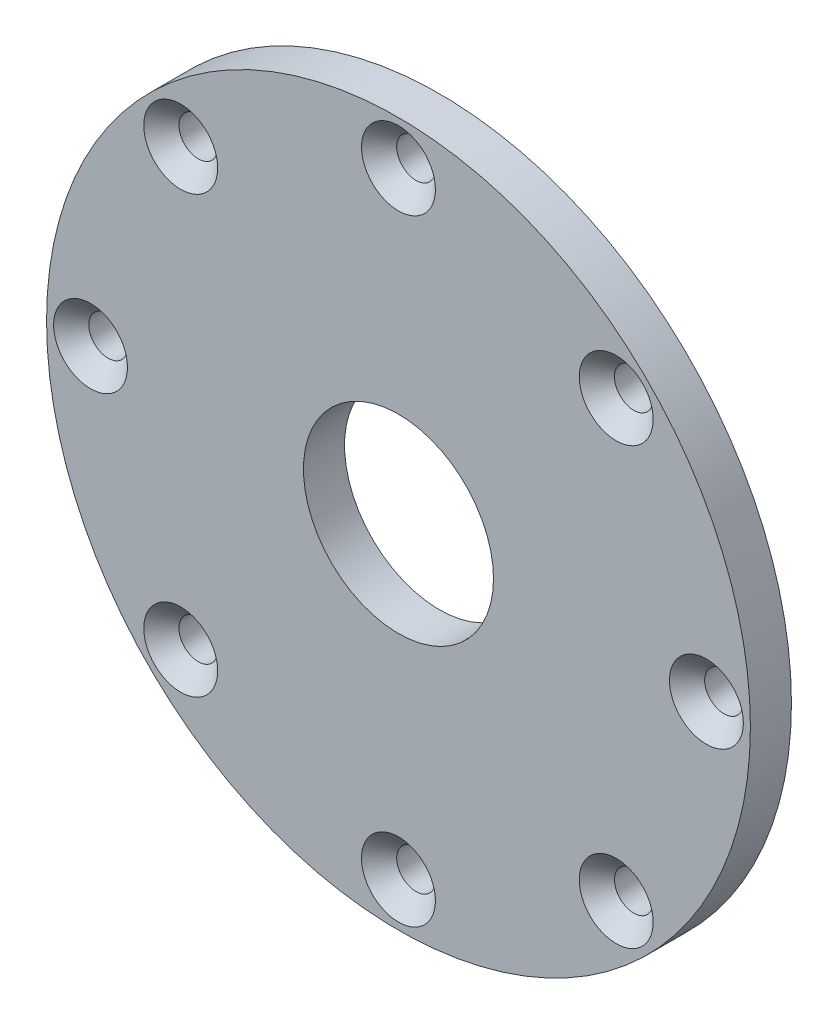
ISO-10303-21;
HEADER;
FILE_DESCRIPTION(('STEP AP214'),'2;1');
FILE_NAME('part.step','',(''),(''),'','','');
FILE_SCHEMA(('AUTOMOTIVE_DESIGN { 1 0 10303 214 1 1 1 1 }'));
ENDSEC;
DATA;
#1=APPLICATION_CONTEXT('core data for automotive mechanical design processes');
#2=APPLICATION_PROTOCOL_DEFINITION('international standard','automotive_design',2000,#1);
#3=PRODUCT_CONTEXT('',#1,'mechanical');
#4=PRODUCT('Part','Part','',(#3));
#5=PRODUCT_RELATED_PRODUCT_CATEGORY('part','',(#4));
#6=PRODUCT_DEFINITION_FORMATION('','',#4);
#7=PRODUCT_DEFINITION_CONTEXT('part definition',#1,'design');
#8=PRODUCT_DEFINITION('design','',#6,#7);
#9=PRODUCT_DEFINITION_SHAPE('','',#8);
#10=(LENGTH_UNIT() NAMED_UNIT(*) SI_UNIT(.MILLI.,.METRE.));
#11=(NAMED_UNIT(*) PLANE_ANGLE_UNIT() SI_UNIT($,.RADIAN.));
#12=(NAMED_UNIT(*) SI_UNIT($,.STERADIAN.) SOLID_ANGLE_UNIT());
#13=UNCERTAINTY_MEASURE_WITH_UNIT(LENGTH_MEASURE(1.E-05),#10,'distance_accuracy_value','');
#14=(GEOMETRIC_REPRESENTATION_CONTEXT(3) GLOBAL_UNCERTAINTY_ASSIGNED_CONTEXT((#13)) GLOBAL_UNIT_ASSIGNED_CONTEXT((#10,
#11,#12)) REPRESENTATION_CONTEXT('',''));
#15=CARTESIAN_POINT('',(0.,0.,0.));
#16=DIRECTION('',(0.,0.,1.));
#17=DIRECTION('',(1.,0.,0.));
#18=AXIS2_PLACEMENT_3D('',#15,#16,#17);
#19=CARTESIAN_POINT('',(0.,0.,7.));
#20=DIRECTION('',(0.,0.,1.));
#21=DIRECTION('',(1.,0.,0.));
#22=AXIS2_PLACEMENT_3D('',#19,#20,#21);
#23=PLANE('',#22);
#24=CARTESIAN_POINT('',(0.,52.5,7.));
#25=DIRECTION('',(0.,0.,1.));
#26=DIRECTION('',(1.,0.,0.));
#27=AXIS2_PLACEMENT_3D('',#24,#25,#26);
#28=CIRCLE('',#27,6.3);
#29=CARTESIAN_POINT('',(6.3,52.5,7.));
#30=VERTEX_POINT('',#29);
#31=EDGE_CURVE('E157',#30,#30,#28,.T.);
#32=ORIENTED_EDGE('',*,*,#31,.F.);
#33=EDGE_LOOP('',(#32));
#34=FACE_BOUND('',#33,.T.);
#35=CARTESIAN_POINT('',(37.1231060122937,37.1231060122937,7.));
#36=DIRECTION('',(0.,0.,1.));
#37=DIRECTION('',(1.,0.,0.));
#38=AXIS2_PLACEMENT_3D('',#35,#36,#37);
#39=CIRCLE('',#38,6.3);
#40=CARTESIAN_POINT('',(43.4231060122937,37.1231060122937,7.));
#41=VERTEX_POINT('',#40);
#42=EDGE_CURVE('E145',#41,#41,#39,.T.);
#43=ORIENTED_EDGE('',*,*,#42,.F.);
#44=EDGE_LOOP('',(#43));
#45=FACE_BOUND('',#44,.T.);
#46=CARTESIAN_POINT('',(52.5,0.,7.));
#47=DIRECTION('',(0.,0.,1.));
#48=DIRECTION('',(1.,0.,0.));
#49=AXIS2_PLACEMENT_3D('',#46,#47,#48);
#50=CIRCLE('',#49,6.3);
#51=CARTESIAN_POINT('',(58.8,0.,7.));
#52=VERTEX_POINT('',#51);
#53=EDGE_CURVE('E133',#52,#52,#50,.T.);
#54=ORIENTED_EDGE('',*,*,#53,.F.);
#55=EDGE_LOOP('',(#54));
#56=FACE_BOUND('',#55,.T.);
#57=CARTESIAN_POINT('',(37.1231060122937,-37.1231060122937,7.));
#58=DIRECTION('',(0.,0.,1.));
#59=DIRECTION('',(1.,0.,0.));
#60=AXIS2_PLACEMENT_3D('',#57,#58,#59);
#61=CIRCLE('',#60,6.3);
#62=CARTESIAN_POINT('',(43.4231060122937,-37.1231060122937,7.));
#63=VERTEX_POINT('',#62);
#64=EDGE_CURVE('E121',#63,#63,#61,.T.);
#65=ORIENTED_EDGE('',*,*,#64,.F.);
#66=EDGE_LOOP('',(#65));
#67=FACE_BOUND('',#66,.T.);
#68=CARTESIAN_POINT('',(0.,-52.5,7.));
#69=DIRECTION('',(0.,0.,1.));
#70=DIRECTION('',(1.,0.,0.));
#71=AXIS2_PLACEMENT_3D('',#68,#69,#70);
#72=CIRCLE('',#71,6.3);
#73=CARTESIAN_POINT('',(6.30000000000001,-52.5,7.));
#74=VERTEX_POINT('',#73);
#75=EDGE_CURVE('E109',#74,#74,#72,.T.);
#76=ORIENTED_EDGE('',*,*,#75,.F.);
#77=EDGE_LOOP('',(#76));
#78=FACE_BOUND('',#77,.T.);
#79=CARTESIAN_POINT('',(-37.1231060122937,-37.1231060122938,7.));
#80=DIRECTION('',(0.,0.,1.));
#81=DIRECTION('',(1.,0.,0.));
#82=AXIS2_PLACEMENT_3D('',#79,#80,#81);
#83=CIRCLE('',#82,6.3);
#84=CARTESIAN_POINT('',(-30.8231060122937,-37.1231060122938,7.));
#85=VERTEX_POINT('',#84);
#86=EDGE_CURVE('E97',#85,#85,#83,.T.);
#87=ORIENTED_EDGE('',*,*,#86,.F.);
#88=EDGE_LOOP('',(#87));
#89=FACE_BOUND('',#88,.T.);
#90=CARTESIAN_POINT('',(-52.5,0.,7.));
#91=DIRECTION('',(0.,0.,1.));
#92=DIRECTION('',(1.,0.,0.));
#93=AXIS2_PLACEMENT_3D('',#90,#91,#92);
#94=CIRCLE('',#93,6.3);
#95=CARTESIAN_POINT('',(-46.2,0.,7.));
#96=VERTEX_POINT('',#95);
#97=EDGE_CURVE('E85',#96,#96,#94,.T.);
#98=ORIENTED_EDGE('',*,*,#97,.F.);
#99=EDGE_LOOP('',(#98));
#100=FACE_BOUND('',#99,.T.);
#101=CARTESIAN_POINT('',(-37.1231060122937,37.1231060122937,7.));
#102=DIRECTION('',(0.,0.,1.));
#103=DIRECTION('',(1.,0.,0.));
#104=AXIS2_PLACEMENT_3D('',#101,#102,#103);
#105=CIRCLE('',#104,6.3);
#106=CARTESIAN_POINT('',(-30.8231060122937,37.1231060122937,7.));
#107=VERTEX_POINT('',#106);
#108=EDGE_CURVE('E73',#107,#107,#105,.T.);
#109=ORIENTED_EDGE('',*,*,#108,.F.);
#110=EDGE_LOOP('',(#109));
#111=FACE_BOUND('',#110,.T.);
#112=CARTESIAN_POINT('',(0.,0.,7.));
#113=DIRECTION('',(0.,0.,1.));
#114=DIRECTION('',(1.,0.,0.));
#115=AXIS2_PLACEMENT_3D('',#112,#113,#114);
#116=CIRCLE('',#115,60.);
#117=CARTESIAN_POINT('',(60.,0.,7.));
#118=VERTEX_POINT('',#117);
#119=EDGE_CURVE('E10',#118,#118,#116,.T.);
#120=ORIENTED_EDGE('',*,*,#119,.T.);
#121=EDGE_LOOP('',(#120));
#122=FACE_BOUND('',#121,.T.);
#123=CARTESIAN_POINT('',(0.,0.,7.));
#124=DIRECTION('',(0.,0.,1.));
#125=DIRECTION('',(1.,0.,0.));
#126=AXIS2_PLACEMENT_3D('',#123,#124,#125);
#127=CIRCLE('',#126,16.2);
#128=CARTESIAN_POINT('',(16.2,0.,7.));
#129=VERTEX_POINT('',#128);
#130=EDGE_CURVE('E56',#129,#129,#127,.T.);
#131=ORIENTED_EDGE('',*,*,#130,.F.);
#132=EDGE_LOOP('',(#131));
#133=FACE_BOUND('',#132,.T.);
#134=ADVANCED_FACE('F43',(#34,#45,#56,#67,#78,#89,#100,#111,#122,#133),#23,.T.);
#135=CARTESIAN_POINT('',(0.,0.,0.));
#136=DIRECTION('',(0.,0.,1.));
#137=DIRECTION('',(1.,0.,0.));
#138=AXIS2_PLACEMENT_3D('',#135,#136,#137);
#139=PLANE('',#138);
#140=CARTESIAN_POINT('',(0.,52.5,0.));
#141=DIRECTION('',(0.,0.,1.));
#142=DIRECTION('',(1.,0.,0.));
#143=AXIS2_PLACEMENT_3D('',#140,#141,#142);
#144=CIRCLE('',#143,3.3);
#145=CARTESIAN_POINT('',(3.29999999999999,52.5,0.));
#146=VERTEX_POINT('',#145);
#147=EDGE_CURVE('E149',#146,#146,#144,.T.);
#148=ORIENTED_EDGE('',*,*,#147,.T.);
#149=EDGE_LOOP('',(#148));
#150=FACE_BOUND('',#149,.T.);
#151=CARTESIAN_POINT('',(37.1231060122937,37.1231060122937,0.));
#152=DIRECTION('',(0.,0.,1.));
#153=DIRECTION('',(1.,0.,0.));
#154=AXIS2_PLACEMENT_3D('',#151,#152,#153);
#155=CIRCLE('',#154,3.3);
#156=CARTESIAN_POINT('',(40.4231060122937,37.1231060122937,0.));
#157=VERTEX_POINT('',#156);
#158=EDGE_CURVE('E137',#157,#157,#155,.T.);
#159=ORIENTED_EDGE('',*,*,#158,.T.);
#160=EDGE_LOOP('',(#159));
#161=FACE_BOUND('',#160,.T.);
#162=CARTESIAN_POINT('',(52.5,0.,0.));
#163=DIRECTION('',(0.,0.,1.));
#164=DIRECTION('',(1.,0.,0.));
#165=AXIS2_PLACEMENT_3D('',#162,#163,#164);
#166=CIRCLE('',#165,3.3);
#167=CARTESIAN_POINT('',(55.8,0.,0.));
#168=VERTEX_POINT('',#167);
#169=EDGE_CURVE('E125',#168,#168,#166,.T.);
#170=ORIENTED_EDGE('',*,*,#169,.T.);
#171=EDGE_LOOP('',(#170));
#172=FACE_BOUND('',#171,.T.);
#173=CARTESIAN_POINT('',(37.1231060122937,-37.1231060122937,0.));
#174=DIRECTION('',(0.,0.,1.));
#175=DIRECTION('',(1.,0.,0.));
#176=AXIS2_PLACEMENT_3D('',#173,#174,#175);
#177=CIRCLE('',#176,3.3);
#178=CARTESIAN_POINT('',(40.4231060122937,-37.1231060122937,0.));
#179=VERTEX_POINT('',#178);
#180=EDGE_CURVE('E113',#179,#179,#177,.T.);
#181=ORIENTED_EDGE('',*,*,#180,.T.);
#182=EDGE_LOOP('',(#181));
#183=FACE_BOUND('',#182,.T.);
#184=CARTESIAN_POINT('',(0.,-52.5,0.));
#185=DIRECTION('',(0.,0.,1.));
#186=DIRECTION('',(1.,0.,0.));
#187=AXIS2_PLACEMENT_3D('',#184,#185,#186);
#188=CIRCLE('',#187,3.3);
#189=CARTESIAN_POINT('',(3.30000000000001,-52.5,0.));
#190=VERTEX_POINT('',#189);
#191=EDGE_CURVE('E101',#190,#190,#188,.T.);
#192=ORIENTED_EDGE('',*,*,#191,.T.);
#193=EDGE_LOOP('',(#192));
#194=FACE_BOUND('',#193,.T.);
#195=CARTESIAN_POINT('',(-37.1231060122937,-37.1231060122938,0.));
#196=DIRECTION('',(0.,0.,1.));
#197=DIRECTION('',(1.,0.,0.));
#198=AXIS2_PLACEMENT_3D('',#195,#196,#197);
#199=CIRCLE('',#198,3.3);
#200=CARTESIAN_POINT('',(-33.8231060122937,-37.1231060122938,0.));
#201=VERTEX_POINT('',#200);
#202=EDGE_CURVE('E89',#201,#201,#199,.T.);
#203=ORIENTED_EDGE('',*,*,#202,.T.);
#204=EDGE_LOOP('',(#203));
#205=FACE_BOUND('',#204,.T.);
#206=CARTESIAN_POINT('',(-52.5,0.,0.));
#207=DIRECTION('',(0.,0.,1.));
#208=DIRECTION('',(1.,0.,0.));
#209=AXIS2_PLACEMENT_3D('',#206,#207,#208);
#210=CIRCLE('',#209,3.3);
#211=CARTESIAN_POINT('',(-49.2,0.,0.));
#212=VERTEX_POINT('',#211);
#213=EDGE_CURVE('E77',#212,#212,#210,.T.);
#214=ORIENTED_EDGE('',*,*,#213,.T.);
#215=EDGE_LOOP('',(#214));
#216=FACE_BOUND('',#215,.T.);
#217=CARTESIAN_POINT('',(-37.1231060122937,37.1231060122937,0.));
#218=DIRECTION('',(0.,0.,1.));
#219=DIRECTION('',(1.,0.,0.));
#220=AXIS2_PLACEMENT_3D('',#217,#218,#219);
#221=CIRCLE('',#220,3.3);
#222=CARTESIAN_POINT('',(-33.8231060122937,37.1231060122937,0.));
#223=VERTEX_POINT('',#222);
#224=EDGE_CURVE('E62',#223,#223,#221,.T.);
#225=ORIENTED_EDGE('',*,*,#224,.T.);
#226=EDGE_LOOP('',(#225));
#227=FACE_BOUND('',#226,.T.);
#228=CARTESIAN_POINT('',(0.,0.,0.));
#229=DIRECTION('',(0.,0.,1.));
#230=DIRECTION('',(1.,0.,0.));
#231=AXIS2_PLACEMENT_3D('',#228,#229,#230);
#232=CIRCLE('',#231,60.);
#233=CARTESIAN_POINT('',(60.,0.,0.));
#234=VERTEX_POINT('',#233);
#235=EDGE_CURVE('E47',#234,#234,#232,.T.);
#236=ORIENTED_EDGE('',*,*,#235,.F.);
#237=EDGE_LOOP('',(#236));
#238=FACE_BOUND('',#237,.T.);
#239=CARTESIAN_POINT('',(0.,0.,0.));
#240=DIRECTION('',(0.,0.,1.));
#241=DIRECTION('',(1.,0.,0.));
#242=AXIS2_PLACEMENT_3D('',#239,#240,#241);
#243=CIRCLE('',#242,16.2);
#244=CARTESIAN_POINT('',(16.2,0.,0.));
#245=VERTEX_POINT('',#244);
#246=EDGE_CURVE('E58',#245,#245,#243,.T.);
#247=ORIENTED_EDGE('',*,*,#246,.T.);
#248=EDGE_LOOP('',(#247));
#249=FACE_BOUND('',#248,.T.);
#250=ADVANCED_FACE('F166',(#150,#161,#172,#183,#194,#205,#216,#227,#238,#249),#139,.F.);
#251=CARTESIAN_POINT('',(0.,0.,7.));
#252=DIRECTION('',(0.,0.,-1.));
#253=DIRECTION('',(-1.,0.,0.));
#254=AXIS2_PLACEMENT_3D('',#251,#252,#253);
#255=CYLINDRICAL_SURFACE('',#254,60.);
#256=ORIENTED_EDGE('',*,*,#119,.F.);
#257=EDGE_LOOP('',(#256));
#258=FACE_BOUND('',#257,.T.);
#259=ORIENTED_EDGE('',*,*,#235,.T.);
#260=EDGE_LOOP('',(#259));
#261=FACE_BOUND('',#260,.T.);
#262=ADVANCED_FACE('F45',(#258,#261),#255,.T.);
#263=CARTESIAN_POINT('',(0.,0.,7.));
#264=DIRECTION('',(0.,0.,-1.));
#265=DIRECTION('',(-1.,0.,0.));
#266=AXIS2_PLACEMENT_3D('',#263,#264,#265);
#267=CYLINDRICAL_SURFACE('',#266,16.2);
#268=ORIENTED_EDGE('',*,*,#130,.T.);
#269=EDGE_LOOP('',(#268));
#270=FACE_BOUND('',#269,.T.);
#271=ORIENTED_EDGE('',*,*,#246,.F.);
#272=EDGE_LOOP('',(#271));
#273=FACE_BOUND('',#272,.T.);
#274=ADVANCED_FACE('F184',(#270,#273),#267,.F.);
#275=CARTESIAN_POINT('',(-37.1231060122937,37.1231060122937,7.));
#276=DIRECTION('',(0.,0.,1.));
#277=DIRECTION('',(1.,0.,0.));
#278=AXIS2_PLACEMENT_3D('',#275,#276,#277);
#279=CYLINDRICAL_SURFACE('',#278,3.3);
#280=ORIENTED_EDGE('',*,*,#224,.F.);
#281=EDGE_LOOP('',(#280));
#282=FACE_BOUND('',#281,.T.);
#283=CARTESIAN_POINT('',(-37.1231060122937,37.1231060122937,4.));
#284=DIRECTION('',(0.,0.,1.));
#285=DIRECTION('',(1.,0.,0.));
#286=AXIS2_PLACEMENT_3D('',#283,#284,#285);
#287=CIRCLE('',#286,3.3);
#288=CARTESIAN_POINT('',(-33.8231060122937,37.1231060122937,4.));
#289=VERTEX_POINT('',#288);
#290=EDGE_CURVE('E69',#289,#289,#287,.T.);
#291=ORIENTED_EDGE('',*,*,#290,.T.);
#292=EDGE_LOOP('',(#291));
#293=FACE_BOUND('',#292,.T.);
#294=ADVANCED_FACE('F187',(#282,#293),#279,.F.);
#295=CARTESIAN_POINT('',(-37.1231060122937,37.1231060122937,7.));
#296=DIRECTION('',(0.,0.,1.));
#297=DIRECTION('',(1.,0.,0.));
#298=AXIS2_PLACEMENT_3D('',#295,#296,#297);
#299=CONICAL_SURFACE('',#298,6.3,0.785398163397449);
#300=ORIENTED_EDGE('',*,*,#290,.F.);
#301=EDGE_LOOP('',(#300));
#302=FACE_BOUND('',#301,.T.);
#303=ORIENTED_EDGE('',*,*,#108,.T.);
#304=EDGE_LOOP('',(#303));
#305=FACE_BOUND('',#304,.T.);
#306=ADVANCED_FACE('F201',(#302,#305),#299,.F.);
#307=CARTESIAN_POINT('',(-52.5,0.,7.));
#308=DIRECTION('',(0.,0.,1.));
#309=DIRECTION('',(1.,0.,0.));
#310=AXIS2_PLACEMENT_3D('',#307,#308,#309);
#311=CYLINDRICAL_SURFACE('',#310,3.3);
#312=ORIENTED_EDGE('',*,*,#213,.F.);
#313=EDGE_LOOP('',(#312));
#314=FACE_BOUND('',#313,.T.);
#315=CARTESIAN_POINT('',(-52.5,0.,4.));
#316=DIRECTION('',(0.,0.,1.));
#317=DIRECTION('',(1.,0.,0.));
#318=AXIS2_PLACEMENT_3D('',#315,#316,#317);
#319=CIRCLE('',#318,3.3);
#320=CARTESIAN_POINT('',(-49.2,0.,4.));
#321=VERTEX_POINT('',#320);
#322=EDGE_CURVE('E81',#321,#321,#319,.T.);
#323=ORIENTED_EDGE('',*,*,#322,.T.);
#324=EDGE_LOOP('',(#323));
#325=FACE_BOUND('',#324,.T.);
#326=ADVANCED_FACE('F205',(#314,#325),#311,.F.);
#327=CARTESIAN_POINT('',(-52.5,0.,7.));
#328=DIRECTION('',(0.,0.,1.));
#329=DIRECTION('',(1.,0.,0.));
#330=AXIS2_PLACEMENT_3D('',#327,#328,#329);
#331=CONICAL_SURFACE('',#330,6.3,0.785398163397449);
#332=ORIENTED_EDGE('',*,*,#322,.F.);
#333=EDGE_LOOP('',(#332));
#334=FACE_BOUND('',#333,.T.);
#335=ORIENTED_EDGE('',*,*,#97,.T.);
#336=EDGE_LOOP('',(#335));
#337=FACE_BOUND('',#336,.T.);
#338=ADVANCED_FACE('F209',(#334,#337),#331,.F.);
#339=CARTESIAN_POINT('',(-37.1231060122937,-37.1231060122938,7.));
#340=DIRECTION('',(0.,0.,1.));
#341=DIRECTION('',(1.,0.,0.));
#342=AXIS2_PLACEMENT_3D('',#339,#340,#341);
#343=CYLINDRICAL_SURFACE('',#342,3.3);
#344=ORIENTED_EDGE('',*,*,#202,.F.);
#345=EDGE_LOOP('',(#344));
#346=FACE_BOUND('',#345,.T.);
#347=CARTESIAN_POINT('',(-37.1231060122937,-37.1231060122938,4.));
#348=DIRECTION('',(0.,0.,1.));
#349=DIRECTION('',(1.,0.,0.));
#350=AXIS2_PLACEMENT_3D('',#347,#348,#349);
#351=CIRCLE('',#350,3.3);
#352=CARTESIAN_POINT('',(-33.8231060122937,-37.1231060122938,4.));
#353=VERTEX_POINT('',#352);
#354=EDGE_CURVE('E93',#353,#353,#351,.T.);
#355=ORIENTED_EDGE('',*,*,#354,.T.);
#356=EDGE_LOOP('',(#355));
#357=FACE_BOUND('',#356,.T.);
#358=ADVANCED_FACE('F213',(#346,#357),#343,.F.);
#359=CARTESIAN_POINT('',(-37.1231060122937,-37.1231060122938,7.));
#360=DIRECTION('',(0.,0.,1.));
#361=DIRECTION('',(1.,0.,0.));
#362=AXIS2_PLACEMENT_3D('',#359,#360,#361);
#363=CONICAL_SURFACE('',#362,6.3,0.785398163397449);
#364=ORIENTED_EDGE('',*,*,#354,.F.);
#365=EDGE_LOOP('',(#364));
#366=FACE_BOUND('',#365,.T.);
#367=ORIENTED_EDGE('',*,*,#86,.T.);
#368=EDGE_LOOP('',(#367));
#369=FACE_BOUND('',#368,.T.);
#370=ADVANCED_FACE('F217',(#366,#369),#363,.F.);
#371=CARTESIAN_POINT('',(0.,-52.5,7.));
#372=DIRECTION('',(0.,0.,1.));
#373=DIRECTION('',(1.,0.,0.));
#374=AXIS2_PLACEMENT_3D('',#371,#372,#373);
#375=CYLINDRICAL_SURFACE('',#374,3.3);
#376=ORIENTED_EDGE('',*,*,#191,.F.);
#377=EDGE_LOOP('',(#376));
#378=FACE_BOUND('',#377,.T.);
#379=CARTESIAN_POINT('',(0.,-52.5,4.));
#380=DIRECTION('',(0.,0.,1.));
#381=DIRECTION('',(1.,0.,0.));
#382=AXIS2_PLACEMENT_3D('',#379,#380,#381);
#383=CIRCLE('',#382,3.3);
#384=CARTESIAN_POINT('',(3.30000000000001,-52.5,4.));
#385=VERTEX_POINT('',#384);
#386=EDGE_CURVE('E105',#385,#385,#383,.T.);
#387=ORIENTED_EDGE('',*,*,#386,.T.);
#388=EDGE_LOOP('',(#387));
#389=FACE_BOUND('',#388,.T.);
#390=ADVANCED_FACE('F221',(#378,#389),#375,.F.);
#391=CARTESIAN_POINT('',(0.,-52.5,7.));
#392=DIRECTION('',(0.,0.,1.));
#393=DIRECTION('',(1.,0.,0.));
#394=AXIS2_PLACEMENT_3D('',#391,#392,#393);
#395=CONICAL_SURFACE('',#394,6.3,0.785398163397448);
#396=ORIENTED_EDGE('',*,*,#386,.F.);
#397=EDGE_LOOP('',(#396));
#398=FACE_BOUND('',#397,.T.);
#399=ORIENTED_EDGE('',*,*,#75,.T.);
#400=EDGE_LOOP('',(#399));
#401=FACE_BOUND('',#400,.T.);
#402=ADVANCED_FACE('F225',(#398,#401),#395,.F.);
#403=CARTESIAN_POINT('',(37.1231060122937,-37.1231060122937,7.));
#404=DIRECTION('',(0.,0.,1.));
#405=DIRECTION('',(1.,0.,0.));
#406=AXIS2_PLACEMENT_3D('',#403,#404,#405);
#407=CYLINDRICAL_SURFACE('',#406,3.3);
#408=ORIENTED_EDGE('',*,*,#180,.F.);
#409=EDGE_LOOP('',(#408));
#410=FACE_BOUND('',#409,.T.);
#411=CARTESIAN_POINT('',(37.1231060122937,-37.1231060122937,4.));
#412=DIRECTION('',(0.,0.,1.));
#413=DIRECTION('',(1.,0.,0.));
#414=AXIS2_PLACEMENT_3D('',#411,#412,#413);
#415=CIRCLE('',#414,3.3);
#416=CARTESIAN_POINT('',(40.4231060122937,-37.1231060122937,4.));
#417=VERTEX_POINT('',#416);
#418=EDGE_CURVE('E117',#417,#417,#415,.T.);
#419=ORIENTED_EDGE('',*,*,#418,.T.);
#420=EDGE_LOOP('',(#419));
#421=FACE_BOUND('',#420,.T.);
#422=ADVANCED_FACE('F229',(#410,#421),#407,.F.);
#423=CARTESIAN_POINT('',(37.1231060122937,-37.1231060122937,7.));
#424=DIRECTION('',(0.,0.,1.));
#425=DIRECTION('',(1.,0.,0.));
#426=AXIS2_PLACEMENT_3D('',#423,#424,#425);
#427=CONICAL_SURFACE('',#426,6.3,0.785398163397449);
#428=ORIENTED_EDGE('',*,*,#418,.F.);
#429=EDGE_LOOP('',(#428));
#430=FACE_BOUND('',#429,.T.);
#431=ORIENTED_EDGE('',*,*,#64,.T.);
#432=EDGE_LOOP('',(#431));
#433=FACE_BOUND('',#432,.T.);
#434=ADVANCED_FACE('F233',(#430,#433),#427,.F.);
#435=CARTESIAN_POINT('',(52.5,0.,7.));
#436=DIRECTION('',(0.,0.,1.));
#437=DIRECTION('',(1.,0.,0.));
#438=AXIS2_PLACEMENT_3D('',#435,#436,#437);
#439=CYLINDRICAL_SURFACE('',#438,3.3);
#440=ORIENTED_EDGE('',*,*,#169,.F.);
#441=EDGE_LOOP('',(#440));
#442=FACE_BOUND('',#441,.T.);
#443=CARTESIAN_POINT('',(52.5,0.,4.));
#444=DIRECTION('',(0.,0.,1.));
#445=DIRECTION('',(1.,0.,0.));
#446=AXIS2_PLACEMENT_3D('',#443,#444,#445);
#447=CIRCLE('',#446,3.3);
#448=CARTESIAN_POINT('',(55.8,0.,4.));
#449=VERTEX_POINT('',#448);
#450=EDGE_CURVE('E129',#449,#449,#447,.T.);
#451=ORIENTED_EDGE('',*,*,#450,.T.);
#452=EDGE_LOOP('',(#451));
#453=FACE_BOUND('',#452,.T.);
#454=ADVANCED_FACE('F237',(#442,#453),#439,.F.);
#455=CARTESIAN_POINT('',(52.5,0.,7.));
#456=DIRECTION('',(0.,0.,1.));
#457=DIRECTION('',(1.,0.,0.));
#458=AXIS2_PLACEMENT_3D('',#455,#456,#457);
#459=CONICAL_SURFACE('',#458,6.3,0.785398163397449);
#460=ORIENTED_EDGE('',*,*,#450,.F.);
#461=EDGE_LOOP('',(#460));
#462=FACE_BOUND('',#461,.T.);
#463=ORIENTED_EDGE('',*,*,#53,.T.);
#464=EDGE_LOOP('',(#463));
#465=FACE_BOUND('',#464,.T.);
#466=ADVANCED_FACE('F241',(#462,#465),#459,.F.);
#467=CARTESIAN_POINT('',(37.1231060122937,37.1231060122937,7.));
#468=DIRECTION('',(0.,0.,1.));
#469=DIRECTION('',(1.,0.,0.));
#470=AXIS2_PLACEMENT_3D('',#467,#468,#469);
#471=CYLINDRICAL_SURFACE('',#470,3.3);
#472=ORIENTED_EDGE('',*,*,#158,.F.);
#473=EDGE_LOOP('',(#472));
#474=FACE_BOUND('',#473,.T.);
#475=CARTESIAN_POINT('',(37.1231060122937,37.1231060122937,4.));
#476=DIRECTION('',(0.,0.,1.));
#477=DIRECTION('',(1.,0.,0.));
#478=AXIS2_PLACEMENT_3D('',#475,#476,#477);
#479=CIRCLE('',#478,3.3);
#480=CARTESIAN_POINT('',(40.4231060122937,37.1231060122937,4.));
#481=VERTEX_POINT('',#480);
#482=EDGE_CURVE('E141',#481,#481,#479,.T.);
#483=ORIENTED_EDGE('',*,*,#482,.T.);
#484=EDGE_LOOP('',(#483));
#485=FACE_BOUND('',#484,.T.);
#486=ADVANCED_FACE('F245',(#474,#485),#471,.F.);
#487=CARTESIAN_POINT('',(37.1231060122937,37.1231060122937,7.));
#488=DIRECTION('',(0.,0.,1.));
#489=DIRECTION('',(1.,0.,0.));
#490=AXIS2_PLACEMENT_3D('',#487,#488,#489);
#491=CONICAL_SURFACE('',#490,6.3,0.785398163397449);
#492=ORIENTED_EDGE('',*,*,#482,.F.);
#493=EDGE_LOOP('',(#492));
#494=FACE_BOUND('',#493,.T.);
#495=ORIENTED_EDGE('',*,*,#42,.T.);
#496=EDGE_LOOP('',(#495));
#497=FACE_BOUND('',#496,.T.);
#498=ADVANCED_FACE('F249',(#494,#497),#491,.F.);
#499=CARTESIAN_POINT('',(0.,52.5,7.));
#500=DIRECTION('',(0.,0.,1.));
#501=DIRECTION('',(1.,0.,0.));
#502=AXIS2_PLACEMENT_3D('',#499,#500,#501);
#503=CYLINDRICAL_SURFACE('',#502,3.3);
#504=ORIENTED_EDGE('',*,*,#147,.F.);
#505=EDGE_LOOP('',(#504));
#506=FACE_BOUND('',#505,.T.);
#507=CARTESIAN_POINT('',(0.,52.5,4.));
#508=DIRECTION('',(0.,0.,1.));
#509=DIRECTION('',(1.,0.,0.));
#510=AXIS2_PLACEMENT_3D('',#507,#508,#509);
#511=CIRCLE('',#510,3.3);
#512=CARTESIAN_POINT('',(3.3,52.5,4.));
#513=VERTEX_POINT('',#512);
#514=EDGE_CURVE('E153',#513,#513,#511,.T.);
#515=ORIENTED_EDGE('',*,*,#514,.T.);
#516=EDGE_LOOP('',(#515));
#517=FACE_BOUND('',#516,.T.);
#518=ADVANCED_FACE('F253',(#506,#517),#503,.F.);
#519=CARTESIAN_POINT('',(0.,52.5,7.));
#520=DIRECTION('',(0.,0.,1.));
#521=DIRECTION('',(1.,0.,0.));
#522=AXIS2_PLACEMENT_3D('',#519,#520,#521);
#523=CONICAL_SURFACE('',#522,6.3,0.785398163397448);
#524=ORIENTED_EDGE('',*,*,#514,.F.);
#525=EDGE_LOOP('',(#524));
#526=FACE_BOUND('',#525,.T.);
#527=ORIENTED_EDGE('',*,*,#31,.T.);
#528=EDGE_LOOP('',(#527));
#529=FACE_BOUND('',#528,.T.);
#530=ADVANCED_FACE('F162',(#526,#529),#523,.F.);
#531=CLOSED_SHELL('',(#134,#250,#262,#274,#294,#306,#326,#338,#358,#370,#390,#402,#422,#434,
#454,#466,#486,#498,#518,#530));
#532=MANIFOLD_SOLID_BREP('B2',#531);
#533=ADVANCED_BREP_SHAPE_REPRESENTATION('',(#18,#532),#14);
#534=SHAPE_DEFINITION_REPRESENTATION(#9,#533);
ENDSEC;
END-ISO-10303-21;
